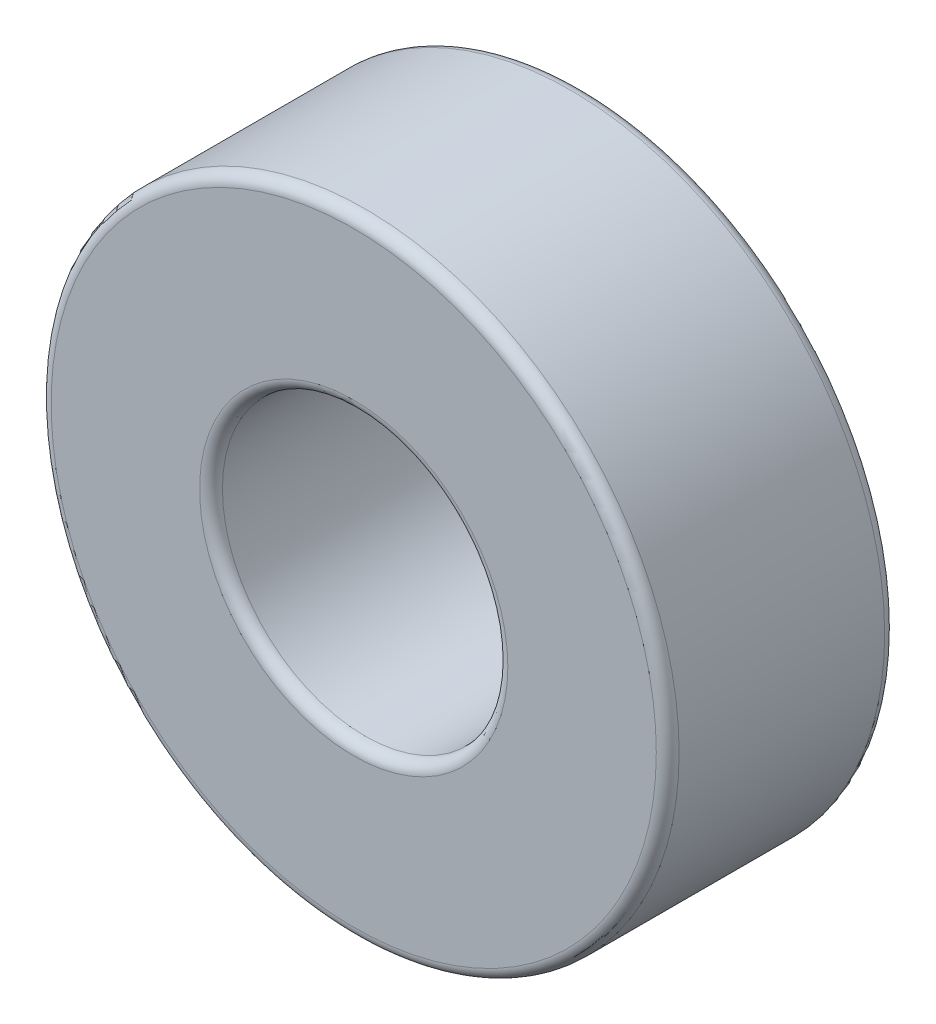
ISO-10303-21;
HEADER;
FILE_DESCRIPTION(('STEP AP214'),'2;1');
FILE_NAME('part.step','',(''),(''),'','','');
FILE_SCHEMA(('AUTOMOTIVE_DESIGN { 1 0 10303 214 1 1 1 1 }'));
ENDSEC;
DATA;
#1=APPLICATION_CONTEXT('core data for automotive mechanical design processes');
#2=APPLICATION_PROTOCOL_DEFINITION('international standard','automotive_design',2000,#1);
#3=PRODUCT_CONTEXT('',#1,'mechanical');
#4=PRODUCT('Part','Part','',(#3));
#5=PRODUCT_RELATED_PRODUCT_CATEGORY('part','',(#4));
#6=PRODUCT_DEFINITION_FORMATION('','',#4);
#7=PRODUCT_DEFINITION_CONTEXT('part definition',#1,'design');
#8=PRODUCT_DEFINITION('design','',#6,#7);
#9=PRODUCT_DEFINITION_SHAPE('','',#8);
#10=(LENGTH_UNIT() NAMED_UNIT(*) SI_UNIT(.MILLI.,.METRE.));
#11=(NAMED_UNIT(*) PLANE_ANGLE_UNIT() SI_UNIT($,.RADIAN.));
#12=(NAMED_UNIT(*) SI_UNIT($,.STERADIAN.) SOLID_ANGLE_UNIT());
#13=UNCERTAINTY_MEASURE_WITH_UNIT(LENGTH_MEASURE(1.E-05),#10,'distance_accuracy_value','');
#14=(GEOMETRIC_REPRESENTATION_CONTEXT(3) GLOBAL_UNCERTAINTY_ASSIGNED_CONTEXT((#13)) GLOBAL_UNIT_ASSIGNED_CONTEXT((#10,
#11,#12)) REPRESENTATION_CONTEXT('',''));
#15=CARTESIAN_POINT('',(0.,0.,0.));
#16=DIRECTION('',(0.,0.,1.));
#17=DIRECTION('',(1.,0.,0.));
#18=AXIS2_PLACEMENT_3D('',#15,#16,#17);
#19=CARTESIAN_POINT('',(0.,0.,4.));
#20=DIRECTION('',(0.,0.,1.));
#21=DIRECTION('',(1.,0.,0.));
#22=AXIS2_PLACEMENT_3D('',#19,#20,#21);
#23=PLANE('',#22);
#24=CARTESIAN_POINT('',(0.,0.,4.));
#25=DIRECTION('',(0.,0.,1.));
#26=DIRECTION('',(1.,0.,0.));
#27=AXIS2_PLACEMENT_3D('',#24,#25,#26);
#28=CIRCLE('',#27,5.3);
#29=CARTESIAN_POINT('',(5.3,0.,4.));
#30=VERTEX_POINT('',#29);
#31=EDGE_CURVE('E10',#30,#30,#28,.T.);
#32=ORIENTED_EDGE('',*,*,#31,.T.);
#33=EDGE_LOOP('',(#32));
#34=FACE_BOUND('',#33,.T.);
#35=CARTESIAN_POINT('',(0.,0.,4.));
#36=DIRECTION('',(0.,0.,1.));
#37=DIRECTION('',(1.,0.,0.));
#38=AXIS2_PLACEMENT_3D('',#35,#36,#37);
#39=CIRCLE('',#38,2.7);
#40=CARTESIAN_POINT('',(2.7,0.,4.));
#41=VERTEX_POINT('',#40);
#42=EDGE_CURVE('E38',#41,#41,#39,.F.);
#43=ORIENTED_EDGE('',*,*,#42,.T.);
#44=EDGE_LOOP('',(#43));
#45=FACE_BOUND('',#44,.T.);
#46=ADVANCED_FACE('F31',(#34,#45),#23,.T.);
#47=CARTESIAN_POINT('',(0.,0.,0.));
#48=DIRECTION('',(0.,0.,1.));
#49=DIRECTION('',(1.,0.,0.));
#50=AXIS2_PLACEMENT_3D('',#47,#48,#49);
#51=PLANE('',#50);
#52=CARTESIAN_POINT('',(0.,0.,0.));
#53=DIRECTION('',(0.,0.,1.));
#54=DIRECTION('',(1.,0.,0.));
#55=AXIS2_PLACEMENT_3D('',#52,#53,#54);
#56=CIRCLE('',#55,2.7);
#57=CARTESIAN_POINT('',(2.7,0.,0.));
#58=VERTEX_POINT('',#57);
#59=EDGE_CURVE('E57',#58,#58,#56,.T.);
#60=ORIENTED_EDGE('',*,*,#59,.T.);
#61=EDGE_LOOP('',(#60));
#62=FACE_BOUND('',#61,.T.);
#63=CARTESIAN_POINT('',(0.,0.,0.));
#64=DIRECTION('',(0.,0.,1.));
#65=DIRECTION('',(1.,0.,0.));
#66=AXIS2_PLACEMENT_3D('',#63,#64,#65);
#67=CIRCLE('',#66,5.3);
#68=CARTESIAN_POINT('',(5.3,0.,0.));
#69=VERTEX_POINT('',#68);
#70=EDGE_CURVE('E60',#69,#69,#67,.F.);
#71=ORIENTED_EDGE('',*,*,#70,.T.);
#72=EDGE_LOOP('',(#71));
#73=FACE_BOUND('',#72,.T.);
#74=ADVANCED_FACE('F64',(#62,#73),#51,.F.);
#75=CARTESIAN_POINT('',(0.,0.,4.));
#76=DIRECTION('',(0.,0.,-1.));
#77=DIRECTION('',(-1.,0.,0.));
#78=AXIS2_PLACEMENT_3D('',#75,#76,#77);
#79=CYLINDRICAL_SURFACE('',#78,5.5);
#80=CARTESIAN_POINT('',(0.,0.,0.2));
#81=DIRECTION('',(0.,0.,1.));
#82=DIRECTION('',(1.,0.,0.));
#83=AXIS2_PLACEMENT_3D('',#80,#81,#82);
#84=CIRCLE('',#83,5.5);
#85=CARTESIAN_POINT('',(5.5,0.,0.2));
#86=VERTEX_POINT('',#85);
#87=EDGE_CURVE('E42',#86,#86,#84,.T.);
#88=ORIENTED_EDGE('',*,*,#87,.T.);
#89=EDGE_LOOP('',(#88));
#90=FACE_BOUND('',#89,.T.);
#91=CARTESIAN_POINT('',(0.,0.,3.8));
#92=DIRECTION('',(0.,0.,1.));
#93=DIRECTION('',(1.,0.,0.));
#94=AXIS2_PLACEMENT_3D('',#91,#92,#93);
#95=CIRCLE('',#94,5.5);
#96=CARTESIAN_POINT('',(5.5,0.,3.8));
#97=VERTEX_POINT('',#96);
#98=EDGE_CURVE('E46',#97,#97,#95,.F.);
#99=ORIENTED_EDGE('',*,*,#98,.T.);
#100=EDGE_LOOP('',(#99));
#101=FACE_BOUND('',#100,.T.);
#102=ADVANCED_FACE('F74',(#90,#101),#79,.T.);
#103=CARTESIAN_POINT('',(0.,0.,4.));
#104=DIRECTION('',(0.,0.,-1.));
#105=DIRECTION('',(-1.,0.,0.));
#106=AXIS2_PLACEMENT_3D('',#103,#104,#105);
#107=CYLINDRICAL_SURFACE('',#106,2.5);
#108=CARTESIAN_POINT('',(0.,0.,0.2));
#109=DIRECTION('',(0.,0.,1.));
#110=DIRECTION('',(1.,0.,0.));
#111=AXIS2_PLACEMENT_3D('',#108,#109,#110);
#112=CIRCLE('',#111,2.5);
#113=CARTESIAN_POINT('',(2.5,0.,0.2));
#114=VERTEX_POINT('',#113);
#115=EDGE_CURVE('E51',#114,#114,#112,.F.);
#116=ORIENTED_EDGE('',*,*,#115,.T.);
#117=EDGE_LOOP('',(#116));
#118=FACE_BOUND('',#117,.T.);
#119=CARTESIAN_POINT('',(0.,0.,3.8));
#120=DIRECTION('',(0.,0.,1.));
#121=DIRECTION('',(1.,0.,0.));
#122=AXIS2_PLACEMENT_3D('',#119,#120,#121);
#123=CIRCLE('',#122,2.5);
#124=CARTESIAN_POINT('',(2.5,0.,3.8));
#125=VERTEX_POINT('',#124);
#126=EDGE_CURVE('E54',#125,#125,#123,.T.);
#127=ORIENTED_EDGE('',*,*,#126,.T.);
#128=EDGE_LOOP('',(#127));
#129=FACE_BOUND('',#128,.T.);
#130=ADVANCED_FACE('F77',(#118,#129),#107,.F.);
#131=CARTESIAN_POINT('',(0.,0.,0.2));
#132=DIRECTION('',(0.,0.,1.));
#133=DIRECTION('',(1.,0.,0.));
#134=AXIS2_PLACEMENT_3D('',#131,#132,#133);
#135=TOROIDAL_SURFACE('',#134,2.7,0.2);
#136=ORIENTED_EDGE('',*,*,#115,.F.);
#137=EDGE_LOOP('',(#136));
#138=FACE_BOUND('',#137,.T.);
#139=ORIENTED_EDGE('',*,*,#59,.F.);
#140=EDGE_LOOP('',(#139));
#141=FACE_BOUND('',#140,.T.);
#142=ADVANCED_FACE('F70',(#138,#141),#135,.T.);
#143=CARTESIAN_POINT('',(0.,0.,0.2));
#144=DIRECTION('',(0.,0.,1.));
#145=DIRECTION('',(1.,0.,0.));
#146=AXIS2_PLACEMENT_3D('',#143,#144,#145);
#147=TOROIDAL_SURFACE('',#146,5.3,0.2);
#148=ORIENTED_EDGE('',*,*,#70,.F.);
#149=EDGE_LOOP('',(#148));
#150=FACE_BOUND('',#149,.T.);
#151=ORIENTED_EDGE('',*,*,#87,.F.);
#152=EDGE_LOOP('',(#151));
#153=FACE_BOUND('',#152,.T.);
#154=ADVANCED_FACE('F66',(#150,#153),#147,.T.);
#155=CARTESIAN_POINT('',(0.,0.,3.8));
#156=DIRECTION('',(0.,0.,1.));
#157=DIRECTION('',(1.,0.,0.));
#158=AXIS2_PLACEMENT_3D('',#155,#156,#157);
#159=TOROIDAL_SURFACE('',#158,5.3,0.2);
#160=ORIENTED_EDGE('',*,*,#98,.F.);
#161=EDGE_LOOP('',(#160));
#162=FACE_BOUND('',#161,.T.);
#163=ORIENTED_EDGE('',*,*,#31,.F.);
#164=EDGE_LOOP('',(#163));
#165=FACE_BOUND('',#164,.T.);
#166=ADVANCED_FACE('F69',(#162,#165),#159,.T.);
#167=CARTESIAN_POINT('',(0.,0.,3.8));
#168=DIRECTION('',(0.,0.,1.));
#169=DIRECTION('',(1.,0.,0.));
#170=AXIS2_PLACEMENT_3D('',#167,#168,#169);
#171=TOROIDAL_SURFACE('',#170,2.7,0.2);
#172=ORIENTED_EDGE('',*,*,#42,.F.);
#173=EDGE_LOOP('',(#172));
#174=FACE_BOUND('',#173,.T.);
#175=ORIENTED_EDGE('',*,*,#126,.F.);
#176=EDGE_LOOP('',(#175));
#177=FACE_BOUND('',#176,.T.);
#178=ADVANCED_FACE('F33',(#174,#177),#171,.T.);
#179=CLOSED_SHELL('',(#46,#74,#102,#130,#142,#154,#166,#178));
#180=MANIFOLD_SOLID_BREP('B2',#179);
#181=ADVANCED_BREP_SHAPE_REPRESENTATION('',(#18,#180),#14);
#182=SHAPE_DEFINITION_REPRESENTATION(#9,#181);
ENDSEC;
END-ISO-10303-21;
